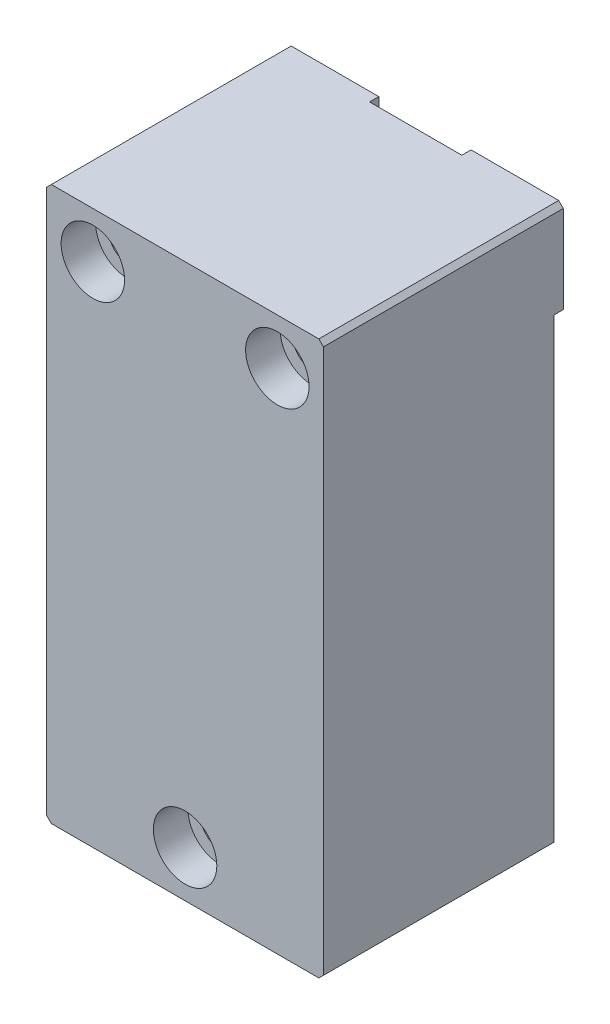
ISO-10303-21;
HEADER;
FILE_DESCRIPTION(('STEP AP214'),'2;1');
FILE_NAME('part.step','',(''),(''),'','','');
FILE_SCHEMA(('AUTOMOTIVE_DESIGN { 1 0 10303 214 1 1 1 1 }'));
ENDSEC;
DATA;
#1=APPLICATION_CONTEXT('core data for automotive mechanical design processes');
#2=APPLICATION_PROTOCOL_DEFINITION('international standard','automotive_design',2000,#1);
#3=PRODUCT_CONTEXT('',#1,'mechanical');
#4=PRODUCT('Part','Part','',(#3));
#5=PRODUCT_RELATED_PRODUCT_CATEGORY('part','',(#4));
#6=PRODUCT_DEFINITION_FORMATION('','',#4);
#7=PRODUCT_DEFINITION_CONTEXT('part definition',#1,'design');
#8=PRODUCT_DEFINITION('design','',#6,#7);
#9=PRODUCT_DEFINITION_SHAPE('','',#8);
#10=(LENGTH_UNIT() NAMED_UNIT(*) SI_UNIT(.MILLI.,.METRE.));
#11=(NAMED_UNIT(*) PLANE_ANGLE_UNIT() SI_UNIT($,.RADIAN.));
#12=(NAMED_UNIT(*) SI_UNIT($,.STERADIAN.) SOLID_ANGLE_UNIT());
#13=UNCERTAINTY_MEASURE_WITH_UNIT(LENGTH_MEASURE(1.E-05),#10,'distance_accuracy_value','');
#14=(GEOMETRIC_REPRESENTATION_CONTEXT(3) GLOBAL_UNCERTAINTY_ASSIGNED_CONTEXT((#13)) GLOBAL_UNIT_ASSIGNED_CONTEXT((#10,
#11,#12)) REPRESENTATION_CONTEXT('',''));
#15=CARTESIAN_POINT('',(0.,0.,0.));
#16=DIRECTION('',(0.,0.,1.));
#17=DIRECTION('',(1.,0.,0.));
#18=AXIS2_PLACEMENT_3D('',#15,#16,#17);
#19=CARTESIAN_POINT('',(-38.1,-114.3,0.));
#20=DIRECTION('',(0.,0.,1.));
#21=DIRECTION('',(1.,0.,0.));
#22=AXIS2_PLACEMENT_3D('',#19,#20,#21);
#23=PLANE('',#22);
#24=DIRECTION('',(0.,1.,0.));
#25=VECTOR('',#24,1.);
#26=CARTESIAN_POINT('',(38.1,38.1,0.));
#27=LINE('',#26,#25);
#28=CARTESIAN_POINT('',(38.1000000000001,-113.03,0.));
#29=VERTEX_POINT('',#28);
#30=CARTESIAN_POINT('',(38.1,12.7,0.));
#31=VERTEX_POINT('',#30);
#32=EDGE_CURVE('E247',#29,#31,#27,.T.);
#33=ORIENTED_EDGE('',*,*,#32,.F.);
#34=DIRECTION('',(0.707106781186551,0.707106781186544,0.));
#35=VECTOR('',#34,1.);
#36=CARTESIAN_POINT('',(38.1,-113.03,0.));
#37=LINE('',#36,#35);
#38=CARTESIAN_POINT('',(36.83,-114.3,0.));
#39=VERTEX_POINT('',#38);
#40=EDGE_CURVE('E356',#29,#39,#37,.F.);
#41=ORIENTED_EDGE('',*,*,#40,.T.);
#42=DIRECTION('',(1.,0.,0.));
#43=VECTOR('',#42,1.);
#44=CARTESIAN_POINT('',(-38.1,-114.3,0.));
#45=LINE('',#44,#43);
#46=CARTESIAN_POINT('',(12.7,-114.3,0.));
#47=VERTEX_POINT('',#46);
#48=EDGE_CURVE('E273',#47,#39,#45,.T.);
#49=ORIENTED_EDGE('',*,*,#48,.F.);
#50=DIRECTION('',(0.,-1.,0.));
#51=VECTOR('',#50,1.);
#52=CARTESIAN_POINT('',(12.7,-114.3,0.));
#53=LINE('',#52,#51);
#54=CARTESIAN_POINT('',(12.7,-88.9,0.));
#55=VERTEX_POINT('',#54);
#56=EDGE_CURVE('E181',#55,#47,#53,.T.);
#57=ORIENTED_EDGE('',*,*,#56,.F.);
#58=DIRECTION('',(1.,0.,0.));
#59=VECTOR('',#58,1.);
#60=CARTESIAN_POINT('',(12.7,-88.9,0.));
#61=LINE('',#60,#59);
#62=CARTESIAN_POINT('',(-12.7,-88.9,0.));
#63=VERTEX_POINT('',#62);
#64=EDGE_CURVE('E177',#63,#55,#61,.T.);
#65=ORIENTED_EDGE('',*,*,#64,.F.);
#66=DIRECTION('',(0.,1.,0.));
#67=VECTOR('',#66,1.);
#68=CARTESIAN_POINT('',(-12.7,-114.3,0.));
#69=LINE('',#68,#67);
#70=CARTESIAN_POINT('',(-12.7,-114.3,0.));
#71=VERTEX_POINT('',#70);
#72=EDGE_CURVE('E370',#71,#63,#69,.T.);
#73=ORIENTED_EDGE('',*,*,#72,.F.);
#74=CARTESIAN_POINT('',(-36.83,-114.3,0.));
#75=VERTEX_POINT('',#74);
#76=EDGE_CURVE('E251',#75,#71,#45,.T.);
#77=ORIENTED_EDGE('',*,*,#76,.F.);
#78=DIRECTION('',(0.707106781186548,-0.707106781186548,0.));
#79=VECTOR('',#78,1.);
#80=CARTESIAN_POINT('',(-36.83,-114.3,0.));
#81=LINE('',#80,#79);
#82=CARTESIAN_POINT('',(-38.1,-113.03,0.));
#83=VERTEX_POINT('',#82);
#84=EDGE_CURVE('E305',#75,#83,#81,.F.);
#85=ORIENTED_EDGE('',*,*,#84,.T.);
#86=DIRECTION('',(0.,-1.,0.));
#87=VECTOR('',#86,1.);
#88=CARTESIAN_POINT('',(-38.1,38.1,0.));
#89=LINE('',#88,#87);
#90=CARTESIAN_POINT('',(-38.1,12.7,0.));
#91=VERTEX_POINT('',#90);
#92=EDGE_CURVE('E268',#91,#83,#89,.T.);
#93=ORIENTED_EDGE('',*,*,#92,.F.);
#94=DIRECTION('',(-1.,0.,0.));
#95=VECTOR('',#94,1.);
#96=CARTESIAN_POINT('',(-38.1,12.7,0.));
#97=LINE('',#96,#95);
#98=CARTESIAN_POINT('',(-12.7,12.7,0.));
#99=VERTEX_POINT('',#98);
#100=EDGE_CURVE('E184',#99,#91,#97,.T.);
#101=ORIENTED_EDGE('',*,*,#100,.F.);
#102=DIRECTION('',(0.,-1.,0.));
#103=VECTOR('',#102,1.);
#104=CARTESIAN_POINT('',(-12.7,38.1,0.));
#105=LINE('',#104,#103);
#106=CARTESIAN_POINT('',(-12.7,38.1,0.));
#107=VERTEX_POINT('',#106);
#108=EDGE_CURVE('E182',#107,#99,#105,.T.);
#109=ORIENTED_EDGE('',*,*,#108,.F.);
#110=DIRECTION('',(-1.,0.,0.));
#111=VECTOR('',#110,1.);
#112=CARTESIAN_POINT('',(-38.1,38.1,0.));
#113=LINE('',#112,#111);
#114=CARTESIAN_POINT('',(12.7,38.1,0.));
#115=VERTEX_POINT('',#114);
#116=EDGE_CURVE('E250',#115,#107,#113,.T.);
#117=ORIENTED_EDGE('',*,*,#116,.F.);
#118=DIRECTION('',(0.,1.,0.));
#119=VECTOR('',#118,1.);
#120=CARTESIAN_POINT('',(12.7,38.1,0.));
#121=LINE('',#120,#119);
#122=CARTESIAN_POINT('',(12.7,12.7,0.));
#123=VERTEX_POINT('',#122);
#124=EDGE_CURVE('E211',#123,#115,#121,.T.);
#125=ORIENTED_EDGE('',*,*,#124,.F.);
#126=DIRECTION('',(-1.,0.,0.));
#127=VECTOR('',#126,1.);
#128=CARTESIAN_POINT('',(38.1,12.7,0.));
#129=LINE('',#128,#127);
#130=EDGE_CURVE('E207',#31,#123,#129,.T.);
#131=ORIENTED_EDGE('',*,*,#130,.F.);
#132=EDGE_LOOP('',(#33,#41,#49,#57,#65,#73,#77,#85,#93,#101,#109,#117,#125,#131));
#133=FACE_BOUND('',#132,.T.);
#134=ADVANCED_FACE('F32',(#133),#23,.F.);
#135=CARTESIAN_POINT('',(-38.1,38.1,63.5));
#136=DIRECTION('',(1.,0.,0.));
#137=DIRECTION('',(0.,1.,0.));
#138=AXIS2_PLACEMENT_3D('',#135,#136,#137);
#139=PLANE('',#138);
#140=ORIENTED_EDGE('',*,*,#92,.T.);
#141=DIRECTION('',(0.,0.,1.));
#142=VECTOR('',#141,1.);
#143=CARTESIAN_POINT('',(-38.1,-113.03,63.5));
#144=LINE('',#143,#142);
#145=CARTESIAN_POINT('',(-38.1,-113.03,63.5));
#146=VERTEX_POINT('',#145);
#147=EDGE_CURVE('E329',#83,#146,#144,.T.);
#148=ORIENTED_EDGE('',*,*,#147,.T.);
#149=DIRECTION('',(0.,-1.,0.));
#150=VECTOR('',#149,1.);
#151=CARTESIAN_POINT('',(-38.1,38.1,63.5));
#152=LINE('',#151,#150);
#153=CARTESIAN_POINT('',(-38.1,36.83,63.5));
#154=VERTEX_POINT('',#153);
#155=EDGE_CURVE('E262',#154,#146,#152,.T.);
#156=ORIENTED_EDGE('',*,*,#155,.F.);
#157=DIRECTION('',(0.,0.,-1.));
#158=VECTOR('',#157,1.);
#159=CARTESIAN_POINT('',(-38.1,36.83,63.5));
#160=LINE('',#159,#158);
#161=CARTESIAN_POINT('',(-38.1,36.83,-2.54));
#162=VERTEX_POINT('',#161);
#163=EDGE_CURVE('E334',#154,#162,#160,.T.);
#164=ORIENTED_EDGE('',*,*,#163,.T.);
#165=DIRECTION('',(0.,1.,0.));
#166=VECTOR('',#165,1.);
#167=CARTESIAN_POINT('',(-38.1,38.1,-2.54));
#168=LINE('',#167,#166);
#169=CARTESIAN_POINT('',(-38.1,12.7,-2.54));
#170=VERTEX_POINT('',#169);
#171=EDGE_CURVE('E190',#170,#162,#168,.T.);
#172=ORIENTED_EDGE('',*,*,#171,.F.);
#173=DIRECTION('',(0.,0.,1.));
#174=VECTOR('',#173,1.);
#175=CARTESIAN_POINT('',(-38.1,12.7,-2.54));
#176=LINE('',#175,#174);
#177=EDGE_CURVE('E197',#170,#91,#176,.T.);
#178=ORIENTED_EDGE('',*,*,#177,.T.);
#179=EDGE_LOOP('',(#140,#148,#156,#164,#172,#178));
#180=FACE_BOUND('',#179,.T.);
#181=ADVANCED_FACE('F346',(#180),#139,.F.);
#182=CARTESIAN_POINT('',(-38.1,-114.3,63.5));
#183=DIRECTION('',(0.,1.,0.));
#184=DIRECTION('',(0.,0.,1.));
#185=AXIS2_PLACEMENT_3D('',#182,#183,#184);
#186=PLANE('',#185);
#187=ORIENTED_EDGE('',*,*,#48,.T.);
#188=DIRECTION('',(0.,0.,1.));
#189=VECTOR('',#188,1.);
#190=CARTESIAN_POINT('',(36.83,-114.3,63.5));
#191=LINE('',#190,#189);
#192=CARTESIAN_POINT('',(36.83,-114.3,63.5));
#193=VERTEX_POINT('',#192);
#194=EDGE_CURVE('E361',#39,#193,#191,.T.);
#195=ORIENTED_EDGE('',*,*,#194,.T.);
#196=DIRECTION('',(1.,0.,0.));
#197=VECTOR('',#196,1.);
#198=CARTESIAN_POINT('',(-38.1,-114.3,63.5));
#199=LINE('',#198,#197);
#200=CARTESIAN_POINT('',(-36.83,-114.3,63.5));
#201=VERTEX_POINT('',#200);
#202=EDGE_CURVE('E311',#201,#193,#199,.T.);
#203=ORIENTED_EDGE('',*,*,#202,.F.);
#204=DIRECTION('',(0.,0.,-1.));
#205=VECTOR('',#204,1.);
#206=CARTESIAN_POINT('',(-36.83,-114.3,63.5));
#207=LINE('',#206,#205);
#208=EDGE_CURVE('E331',#201,#75,#207,.T.);
#209=ORIENTED_EDGE('',*,*,#208,.T.);
#210=ORIENTED_EDGE('',*,*,#76,.T.);
#211=DIRECTION('',(0.,0.,1.));
#212=VECTOR('',#211,1.);
#213=CARTESIAN_POINT('',(-12.7,-114.3,-2.54));
#214=LINE('',#213,#212);
#215=CARTESIAN_POINT('',(-12.7,-114.3,-2.54));
#216=VERTEX_POINT('',#215);
#217=EDGE_CURVE('E164',#216,#71,#214,.T.);
#218=ORIENTED_EDGE('',*,*,#217,.F.);
#219=DIRECTION('',(-1.,0.,0.));
#220=VECTOR('',#219,1.);
#221=CARTESIAN_POINT('',(12.7,-114.3,-2.54));
#222=LINE('',#221,#220);
#223=CARTESIAN_POINT('',(12.7,-114.3,-2.54));
#224=VERTEX_POINT('',#223);
#225=EDGE_CURVE('E156',#224,#216,#222,.T.);
#226=ORIENTED_EDGE('',*,*,#225,.F.);
#227=DIRECTION('',(0.,0.,1.));
#228=VECTOR('',#227,1.);
#229=CARTESIAN_POINT('',(12.7,-114.3,-2.54));
#230=LINE('',#229,#228);
#231=EDGE_CURVE('E161',#224,#47,#230,.T.);
#232=ORIENTED_EDGE('',*,*,#231,.T.);
#233=EDGE_LOOP('',(#187,#195,#203,#209,#210,#218,#226,#232));
#234=FACE_BOUND('',#233,.T.);
#235=ADVANCED_FACE('F159',(#234),#186,.F.);
#236=CARTESIAN_POINT('',(38.1,38.1,63.5));
#237=DIRECTION('',(-1.,0.,0.));
#238=DIRECTION('',(0.,-1.,0.));
#239=AXIS2_PLACEMENT_3D('',#236,#237,#238);
#240=PLANE('',#239);
#241=DIRECTION('',(0.,1.,0.));
#242=VECTOR('',#241,1.);
#243=CARTESIAN_POINT('',(38.1,38.1,63.5));
#244=LINE('',#243,#242);
#245=CARTESIAN_POINT('',(38.1000000000001,-113.03,63.5));
#246=VERTEX_POINT('',#245);
#247=CARTESIAN_POINT('',(38.1,36.8300000000001,63.5));
#248=VERTEX_POINT('',#247);
#249=EDGE_CURVE('E307',#246,#248,#244,.T.);
#250=ORIENTED_EDGE('',*,*,#249,.F.);
#251=DIRECTION('',(0.,0.,-1.));
#252=VECTOR('',#251,1.);
#253=CARTESIAN_POINT('',(38.1,-113.03,63.5));
#254=LINE('',#253,#252);
#255=EDGE_CURVE('E302',#246,#29,#254,.T.);
#256=ORIENTED_EDGE('',*,*,#255,.T.);
#257=ORIENTED_EDGE('',*,*,#32,.T.);
#258=DIRECTION('',(0.,0.,1.));
#259=VECTOR('',#258,1.);
#260=CARTESIAN_POINT('',(38.1,12.7,-2.54));
#261=LINE('',#260,#259);
#262=CARTESIAN_POINT('',(38.1,12.7,-2.54));
#263=VERTEX_POINT('',#262);
#264=EDGE_CURVE('E266',#263,#31,#261,.T.);
#265=ORIENTED_EDGE('',*,*,#264,.F.);
#266=DIRECTION('',(0.,-1.,0.));
#267=VECTOR('',#266,1.);
#268=CARTESIAN_POINT('',(38.1,38.1,-2.54));
#269=LINE('',#268,#267);
#270=CARTESIAN_POINT('',(38.1,36.83,-2.54));
#271=VERTEX_POINT('',#270);
#272=EDGE_CURVE('E208',#271,#263,#269,.T.);
#273=ORIENTED_EDGE('',*,*,#272,.F.);
#274=DIRECTION('',(0.,0.,1.));
#275=VECTOR('',#274,1.);
#276=CARTESIAN_POINT('',(38.1,36.83,63.5));
#277=LINE('',#276,#275);
#278=EDGE_CURVE('E252',#271,#248,#277,.T.);
#279=ORIENTED_EDGE('',*,*,#278,.T.);
#280=EDGE_LOOP('',(#250,#256,#257,#265,#273,#279));
#281=FACE_BOUND('',#280,.T.);
#282=ADVANCED_FACE('F298',(#281),#240,.F.);
#283=CARTESIAN_POINT('',(-38.1,38.1,63.5));
#284=DIRECTION('',(0.,-1.,0.));
#285=DIRECTION('',(1.,0.,0.));
#286=AXIS2_PLACEMENT_3D('',#283,#284,#285);
#287=PLANE('',#286);
#288=DIRECTION('',(1.,0.,0.));
#289=VECTOR('',#288,1.);
#290=CARTESIAN_POINT('',(-38.1,38.1,-2.54));
#291=LINE('',#290,#289);
#292=CARTESIAN_POINT('',(-36.8299999999999,38.1,-2.54));
#293=VERTEX_POINT('',#292);
#294=CARTESIAN_POINT('',(-12.7,38.1,-2.54));
#295=VERTEX_POINT('',#294);
#296=EDGE_CURVE('E192',#293,#295,#291,.T.);
#297=ORIENTED_EDGE('',*,*,#296,.F.);
#298=DIRECTION('',(0.,0.,1.));
#299=VECTOR('',#298,1.);
#300=CARTESIAN_POINT('',(-36.8299999999999,38.1,63.5));
#301=LINE('',#300,#299);
#302=CARTESIAN_POINT('',(-36.8299999999999,38.1,63.5));
#303=VERTEX_POINT('',#302);
#304=EDGE_CURVE('E40',#293,#303,#301,.T.);
#305=ORIENTED_EDGE('',*,*,#304,.T.);
#306=DIRECTION('',(-1.,0.,0.));
#307=VECTOR('',#306,1.);
#308=CARTESIAN_POINT('',(-38.1,38.1,63.5));
#309=LINE('',#308,#307);
#310=CARTESIAN_POINT('',(36.83,38.1,63.5));
#311=VERTEX_POINT('',#310);
#312=EDGE_CURVE('E303',#311,#303,#309,.T.);
#313=ORIENTED_EDGE('',*,*,#312,.F.);
#314=DIRECTION('',(0.,0.,-1.));
#315=VECTOR('',#314,1.);
#316=CARTESIAN_POINT('',(36.83,38.1,63.5));
#317=LINE('',#316,#315);
#318=CARTESIAN_POINT('',(36.83,38.1,-2.54));
#319=VERTEX_POINT('',#318);
#320=EDGE_CURVE('E292',#311,#319,#317,.T.);
#321=ORIENTED_EDGE('',*,*,#320,.T.);
#322=DIRECTION('',(1.,0.,0.));
#323=VECTOR('',#322,1.);
#324=CARTESIAN_POINT('',(38.1,38.1,-2.54));
#325=LINE('',#324,#323);
#326=CARTESIAN_POINT('',(12.7,38.1,-2.54));
#327=VERTEX_POINT('',#326);
#328=EDGE_CURVE('E215',#327,#319,#325,.T.);
#329=ORIENTED_EDGE('',*,*,#328,.F.);
#330=DIRECTION('',(0.,0.,1.));
#331=VECTOR('',#330,1.);
#332=CARTESIAN_POINT('',(12.7,38.1,-2.54));
#333=LINE('',#332,#331);
#334=EDGE_CURVE('E218',#327,#115,#333,.T.);
#335=ORIENTED_EDGE('',*,*,#334,.T.);
#336=ORIENTED_EDGE('',*,*,#116,.T.);
#337=DIRECTION('',(0.,0.,1.));
#338=VECTOR('',#337,1.);
#339=CARTESIAN_POINT('',(-12.7,38.1,-2.54));
#340=LINE('',#339,#338);
#341=EDGE_CURVE('E205',#295,#107,#340,.T.);
#342=ORIENTED_EDGE('',*,*,#341,.F.);
#343=EDGE_LOOP('',(#297,#305,#313,#321,#329,#335,#336,#342));
#344=FACE_BOUND('',#343,.T.);
#345=ADVANCED_FACE('F288',(#344),#287,.F.);
#346=CARTESIAN_POINT('',(-38.1,-114.3,63.5));
#347=DIRECTION('',(0.,0.,1.));
#348=DIRECTION('',(1.,0.,0.));
#349=AXIS2_PLACEMENT_3D('',#346,#347,#348);
#350=PLANE('',#349);
#351=CARTESIAN_POINT('',(-25.4,25.4,63.5));
#352=DIRECTION('',(0.,0.,1.));
#353=DIRECTION('',(1.,0.,0.));
#354=AXIS2_PLACEMENT_3D('',#351,#352,#353);
#355=CIRCLE('',#354,8.7376);
#356=CARTESIAN_POINT('',(-16.6624,25.4,63.5));
#357=VERTEX_POINT('',#356);
#358=EDGE_CURVE('E402',#357,#357,#355,.T.);
#359=ORIENTED_EDGE('',*,*,#358,.F.);
#360=EDGE_LOOP('',(#359));
#361=FACE_BOUND('',#360,.T.);
#362=CARTESIAN_POINT('',(25.4,25.4,63.5));
#363=DIRECTION('',(0.,0.,1.));
#364=DIRECTION('',(1.,0.,0.));
#365=AXIS2_PLACEMENT_3D('',#362,#363,#364);
#366=CIRCLE('',#365,8.7376);
#367=CARTESIAN_POINT('',(34.1376,25.4,63.5));
#368=VERTEX_POINT('',#367);
#369=EDGE_CURVE('E245',#368,#368,#366,.T.);
#370=ORIENTED_EDGE('',*,*,#369,.F.);
#371=EDGE_LOOP('',(#370));
#372=FACE_BOUND('',#371,.T.);
#373=CARTESIAN_POINT('',(0.,-101.6,63.5));
#374=DIRECTION('',(0.,0.,1.));
#375=DIRECTION('',(1.,0.,0.));
#376=AXIS2_PLACEMENT_3D('',#373,#374,#375);
#377=CIRCLE('',#376,8.7376);
#378=CARTESIAN_POINT('',(8.7376,-101.6,63.5));
#379=VERTEX_POINT('',#378);
#380=EDGE_CURVE('E240',#379,#379,#377,.T.);
#381=ORIENTED_EDGE('',*,*,#380,.F.);
#382=EDGE_LOOP('',(#381));
#383=FACE_BOUND('',#382,.T.);
#384=ORIENTED_EDGE('',*,*,#202,.T.);
#385=DIRECTION('',(-0.707106781186551,-0.707106781186544,0.));
#386=VECTOR('',#385,1.);
#387=CARTESIAN_POINT('',(-0.635000000000385,-151.765,63.5));
#388=LINE('',#387,#386);
#389=EDGE_CURVE('E332',#193,#246,#388,.F.);
#390=ORIENTED_EDGE('',*,*,#389,.T.);
#391=ORIENTED_EDGE('',*,*,#249,.T.);
#392=DIRECTION('',(0.707106781186548,-0.707106781186548,0.));
#393=VECTOR('',#392,1.);
#394=CARTESIAN_POINT('',(75.565,-0.634999999999997,63.5));
#395=LINE('',#394,#393);
#396=EDGE_CURVE('E301',#248,#311,#395,.F.);
#397=ORIENTED_EDGE('',*,*,#396,.T.);
#398=ORIENTED_EDGE('',*,*,#312,.T.);
#399=DIRECTION('',(0.707106781186548,0.707106781186548,0.));
#400=VECTOR('',#399,1.);
#401=CARTESIAN_POINT('',(-113.665,-38.735,63.5));
#402=LINE('',#401,#400);
#403=EDGE_CURVE('E321',#303,#154,#402,.F.);
#404=ORIENTED_EDGE('',*,*,#403,.T.);
#405=ORIENTED_EDGE('',*,*,#155,.T.);
#406=DIRECTION('',(-0.707106781186548,0.707106781186548,0.));
#407=VECTOR('',#406,1.);
#408=CARTESIAN_POINT('',(-37.465,-113.665,63.5));
#409=LINE('',#408,#407);
#410=EDGE_CURVE('E319',#146,#201,#409,.F.);
#411=ORIENTED_EDGE('',*,*,#410,.T.);
#412=EDGE_LOOP('',(#384,#390,#391,#397,#398,#404,#405,#411));
#413=FACE_BOUND('',#412,.T.);
#414=ADVANCED_FACE('F318',(#361,#372,#383,#413),#350,.T.);
#415=CARTESIAN_POINT('',(38.1,12.7,-2.54));
#416=DIRECTION('',(0.,1.,0.));
#417=DIRECTION('',(0.,0.,1.));
#418=AXIS2_PLACEMENT_3D('',#415,#416,#417);
#419=PLANE('',#418);
#420=ORIENTED_EDGE('',*,*,#130,.T.);
#421=DIRECTION('',(0.,0.,1.));
#422=VECTOR('',#421,1.);
#423=CARTESIAN_POINT('',(12.7,12.7,-2.54));
#424=LINE('',#423,#422);
#425=CARTESIAN_POINT('',(12.7,12.7,-2.54));
#426=VERTEX_POINT('',#425);
#427=EDGE_CURVE('E221',#426,#123,#424,.T.);
#428=ORIENTED_EDGE('',*,*,#427,.F.);
#429=DIRECTION('',(-1.,0.,0.));
#430=VECTOR('',#429,1.);
#431=CARTESIAN_POINT('',(38.1,12.7,-2.54));
#432=LINE('',#431,#430);
#433=EDGE_CURVE('E210',#263,#426,#432,.T.);
#434=ORIENTED_EDGE('',*,*,#433,.F.);
#435=ORIENTED_EDGE('',*,*,#264,.T.);
#436=EDGE_LOOP('',(#420,#428,#434,#435));
#437=FACE_BOUND('',#436,.T.);
#438=ADVANCED_FACE('F280',(#437),#419,.F.);
#439=CARTESIAN_POINT('',(12.7,38.1,-2.54));
#440=DIRECTION('',(1.,0.,0.));
#441=DIRECTION('',(0.,1.,0.));
#442=AXIS2_PLACEMENT_3D('',#439,#440,#441);
#443=PLANE('',#442);
#444=ORIENTED_EDGE('',*,*,#124,.T.);
#445=ORIENTED_EDGE('',*,*,#334,.F.);
#446=DIRECTION('',(0.,1.,0.));
#447=VECTOR('',#446,1.);
#448=CARTESIAN_POINT('',(12.7,38.1,-2.54));
#449=LINE('',#448,#447);
#450=EDGE_CURVE('E213',#426,#327,#449,.T.);
#451=ORIENTED_EDGE('',*,*,#450,.F.);
#452=ORIENTED_EDGE('',*,*,#427,.T.);
#453=EDGE_LOOP('',(#444,#445,#451,#452));
#454=FACE_BOUND('',#453,.T.);
#455=ADVANCED_FACE('F278',(#454),#443,.F.);
#456=CARTESIAN_POINT('',(38.1,12.7,-2.54));
#457=DIRECTION('',(0.,0.,-1.));
#458=DIRECTION('',(-1.,0.,0.));
#459=AXIS2_PLACEMENT_3D('',#456,#457,#458);
#460=PLANE('',#459);
#461=CARTESIAN_POINT('',(25.4,25.4,-2.54));
#462=DIRECTION('',(0.,0.,-1.));
#463=DIRECTION('',(-1.,0.,0.));
#464=AXIS2_PLACEMENT_3D('',#461,#462,#463);
#465=CIRCLE('',#464,5.15873999999999);
#466=CARTESIAN_POINT('',(20.24126,25.4,-2.54));
#467=VERTEX_POINT('',#466);
#468=EDGE_CURVE('E237',#467,#467,#465,.T.);
#469=ORIENTED_EDGE('',*,*,#468,.F.);
#470=EDGE_LOOP('',(#469));
#471=FACE_BOUND('',#470,.T.);
#472=ORIENTED_EDGE('',*,*,#328,.T.);
#473=DIRECTION('',(-0.707106781186548,0.707106781186548,0.));
#474=VECTOR('',#473,1.);
#475=CARTESIAN_POINT('',(50.165,24.765,-2.54));
#476=LINE('',#475,#474);
#477=EDGE_CURVE('E11',#319,#271,#476,.F.);
#478=ORIENTED_EDGE('',*,*,#477,.T.);
#479=ORIENTED_EDGE('',*,*,#272,.T.);
#480=ORIENTED_EDGE('',*,*,#433,.T.);
#481=ORIENTED_EDGE('',*,*,#450,.T.);
#482=EDGE_LOOP('',(#472,#478,#479,#480,#481));
#483=FACE_BOUND('',#482,.T.);
#484=ADVANCED_FACE('F294',(#471,#483),#460,.T.);
#485=CARTESIAN_POINT('',(-12.7,38.1,-2.54));
#486=DIRECTION('',(-1.,0.,0.));
#487=DIRECTION('',(0.,-1.,0.));
#488=AXIS2_PLACEMENT_3D('',#485,#486,#487);
#489=PLANE('',#488);
#490=ORIENTED_EDGE('',*,*,#108,.T.);
#491=DIRECTION('',(0.,0.,1.));
#492=VECTOR('',#491,1.);
#493=CARTESIAN_POINT('',(-12.7,12.7,-2.54));
#494=LINE('',#493,#492);
#495=CARTESIAN_POINT('',(-12.7,12.7,-2.54));
#496=VERTEX_POINT('',#495);
#497=EDGE_CURVE('E202',#496,#99,#494,.T.);
#498=ORIENTED_EDGE('',*,*,#497,.F.);
#499=DIRECTION('',(0.,-1.,0.));
#500=VECTOR('',#499,1.);
#501=CARTESIAN_POINT('',(-12.7,38.1,-2.54));
#502=LINE('',#501,#500);
#503=EDGE_CURVE('E194',#295,#496,#502,.T.);
#504=ORIENTED_EDGE('',*,*,#503,.F.);
#505=ORIENTED_EDGE('',*,*,#341,.T.);
#506=EDGE_LOOP('',(#490,#498,#504,#505));
#507=FACE_BOUND('',#506,.T.);
#508=ADVANCED_FACE('F495',(#507),#489,.F.);
#509=CARTESIAN_POINT('',(-38.1,12.7,-2.54));
#510=DIRECTION('',(0.,1.,0.));
#511=DIRECTION('',(-1.,0.,0.));
#512=AXIS2_PLACEMENT_3D('',#509,#510,#511);
#513=PLANE('',#512);
#514=ORIENTED_EDGE('',*,*,#100,.T.);
#515=ORIENTED_EDGE('',*,*,#177,.F.);
#516=DIRECTION('',(-1.,0.,0.));
#517=VECTOR('',#516,1.);
#518=CARTESIAN_POINT('',(-38.1,12.7,-2.54));
#519=LINE('',#518,#517);
#520=EDGE_CURVE('E196',#496,#170,#519,.T.);
#521=ORIENTED_EDGE('',*,*,#520,.F.);
#522=ORIENTED_EDGE('',*,*,#497,.T.);
#523=EDGE_LOOP('',(#514,#515,#521,#522));
#524=FACE_BOUND('',#523,.T.);
#525=ADVANCED_FACE('F352',(#524),#513,.F.);
#526=CARTESIAN_POINT('',(-38.1,12.7,-2.54));
#527=DIRECTION('',(0.,0.,1.));
#528=DIRECTION('',(1.,0.,0.));
#529=AXIS2_PLACEMENT_3D('',#526,#527,#528);
#530=PLANE('',#529);
#531=CARTESIAN_POINT('',(-25.4,25.4,-2.54));
#532=DIRECTION('',(0.,0.,1.));
#533=DIRECTION('',(1.,0.,0.));
#534=AXIS2_PLACEMENT_3D('',#531,#532,#533);
#535=CIRCLE('',#534,5.15873999999999);
#536=CARTESIAN_POINT('',(-20.24126,25.4,-2.54));
#537=VERTEX_POINT('',#536);
#538=EDGE_CURVE('E242',#537,#537,#535,.T.);
#539=ORIENTED_EDGE('',*,*,#538,.T.);
#540=EDGE_LOOP('',(#539));
#541=FACE_BOUND('',#540,.T.);
#542=ORIENTED_EDGE('',*,*,#171,.T.);
#543=DIRECTION('',(-0.707106781186548,-0.707106781186548,0.));
#544=VECTOR('',#543,1.);
#545=CARTESIAN_POINT('',(-38.1,36.83,-2.54));
#546=LINE('',#545,#544);
#547=EDGE_CURVE('E53',#162,#293,#546,.F.);
#548=ORIENTED_EDGE('',*,*,#547,.T.);
#549=ORIENTED_EDGE('',*,*,#296,.T.);
#550=ORIENTED_EDGE('',*,*,#503,.T.);
#551=ORIENTED_EDGE('',*,*,#520,.T.);
#552=EDGE_LOOP('',(#542,#548,#549,#550,#551));
#553=FACE_BOUND('',#552,.T.);
#554=ADVANCED_FACE('F347',(#541,#553),#530,.F.);
#555=CARTESIAN_POINT('',(12.7,-114.3,-2.54));
#556=DIRECTION('',(-1.,0.,0.));
#557=DIRECTION('',(0.,0.,1.));
#558=AXIS2_PLACEMENT_3D('',#555,#556,#557);
#559=PLANE('',#558);
#560=ORIENTED_EDGE('',*,*,#56,.T.);
#561=ORIENTED_EDGE('',*,*,#231,.F.);
#562=DIRECTION('',(0.,-1.,0.));
#563=VECTOR('',#562,1.);
#564=CARTESIAN_POINT('',(12.7,-114.3,-2.54));
#565=LINE('',#564,#563);
#566=CARTESIAN_POINT('',(12.7,-88.9,-2.54));
#567=VERTEX_POINT('',#566);
#568=EDGE_CURVE('E168',#567,#224,#565,.T.);
#569=ORIENTED_EDGE('',*,*,#568,.F.);
#570=DIRECTION('',(0.,0.,1.));
#571=VECTOR('',#570,1.);
#572=CARTESIAN_POINT('',(12.7,-88.9,-2.54));
#573=LINE('',#572,#571);
#574=EDGE_CURVE('E378',#567,#55,#573,.T.);
#575=ORIENTED_EDGE('',*,*,#574,.T.);
#576=EDGE_LOOP('',(#560,#561,#569,#575));
#577=FACE_BOUND('',#576,.T.);
#578=ADVANCED_FACE('F179',(#577),#559,.F.);
#579=CARTESIAN_POINT('',(-12.7,-114.3,-2.54));
#580=DIRECTION('',(1.,0.,0.));
#581=DIRECTION('',(0.,1.,0.));
#582=AXIS2_PLACEMENT_3D('',#579,#580,#581);
#583=PLANE('',#582);
#584=ORIENTED_EDGE('',*,*,#72,.T.);
#585=DIRECTION('',(0.,0.,1.));
#586=VECTOR('',#585,1.);
#587=CARTESIAN_POINT('',(-12.7,-88.9,-2.54));
#588=LINE('',#587,#586);
#589=CARTESIAN_POINT('',(-12.7,-88.9,-2.54));
#590=VERTEX_POINT('',#589);
#591=EDGE_CURVE('E186',#590,#63,#588,.T.);
#592=ORIENTED_EDGE('',*,*,#591,.F.);
#593=DIRECTION('',(0.,1.,0.));
#594=VECTOR('',#593,1.);
#595=CARTESIAN_POINT('',(-12.7,-114.3,-2.54));
#596=LINE('',#595,#594);
#597=EDGE_CURVE('E167',#216,#590,#596,.T.);
#598=ORIENTED_EDGE('',*,*,#597,.F.);
#599=ORIENTED_EDGE('',*,*,#217,.T.);
#600=EDGE_LOOP('',(#584,#592,#598,#599));
#601=FACE_BOUND('',#600,.T.);
#602=ADVANCED_FACE('F368',(#601),#583,.F.);
#603=CARTESIAN_POINT('',(12.7,-88.9,-2.54));
#604=DIRECTION('',(0.,-1.,0.));
#605=DIRECTION('',(0.,0.,-1.));
#606=AXIS2_PLACEMENT_3D('',#603,#604,#605);
#607=PLANE('',#606);
#608=ORIENTED_EDGE('',*,*,#64,.T.);
#609=ORIENTED_EDGE('',*,*,#574,.F.);
#610=DIRECTION('',(1.,0.,0.));
#611=VECTOR('',#610,1.);
#612=CARTESIAN_POINT('',(12.7,-88.9,-2.54));
#613=LINE('',#612,#611);
#614=EDGE_CURVE('E173',#590,#567,#613,.T.);
#615=ORIENTED_EDGE('',*,*,#614,.F.);
#616=ORIENTED_EDGE('',*,*,#591,.T.);
#617=EDGE_LOOP('',(#608,#609,#615,#616));
#618=FACE_BOUND('',#617,.T.);
#619=ADVANCED_FACE('F380',(#618),#607,.F.);
#620=CARTESIAN_POINT('',(12.7,-88.9,-2.54));
#621=DIRECTION('',(0.,0.,1.));
#622=DIRECTION('',(1.,0.,0.));
#623=AXIS2_PLACEMENT_3D('',#620,#621,#622);
#624=PLANE('',#623);
#625=CARTESIAN_POINT('',(0.,-101.6,-2.54));
#626=DIRECTION('',(0.,0.,1.));
#627=DIRECTION('',(1.,0.,0.));
#628=AXIS2_PLACEMENT_3D('',#625,#626,#627);
#629=CIRCLE('',#628,5.15873999999999);
#630=CARTESIAN_POINT('',(5.15874,-101.6,-2.54));
#631=VERTEX_POINT('',#630);
#632=EDGE_CURVE('E233',#631,#631,#629,.T.);
#633=ORIENTED_EDGE('',*,*,#632,.T.);
#634=EDGE_LOOP('',(#633));
#635=FACE_BOUND('',#634,.T.);
#636=ORIENTED_EDGE('',*,*,#568,.T.);
#637=ORIENTED_EDGE('',*,*,#225,.T.);
#638=ORIENTED_EDGE('',*,*,#597,.T.);
#639=ORIENTED_EDGE('',*,*,#614,.T.);
#640=EDGE_LOOP('',(#636,#637,#638,#639));
#641=FACE_BOUND('',#640,.T.);
#642=ADVANCED_FACE('F171',(#635,#641),#624,.F.);
#643=CARTESIAN_POINT('',(0.,-101.6,63.5));
#644=DIRECTION('',(0.,0.,1.));
#645=DIRECTION('',(1.,0.,0.));
#646=AXIS2_PLACEMENT_3D('',#643,#644,#645);
#647=CYLINDRICAL_SURFACE('',#646,5.15873999999999);
#648=CARTESIAN_POINT('',(0.,-101.6,53.975));
#649=DIRECTION('',(0.,0.,1.));
#650=DIRECTION('',(1.,0.,0.));
#651=AXIS2_PLACEMENT_3D('',#648,#649,#650);
#652=CIRCLE('',#651,5.15874000000001);
#653=CARTESIAN_POINT('',(5.15874000000001,-101.6,53.975));
#654=VERTEX_POINT('',#653);
#655=EDGE_CURVE('E236',#654,#654,#652,.T.);
#656=ORIENTED_EDGE('',*,*,#655,.T.);
#657=EDGE_LOOP('',(#656));
#658=FACE_BOUND('',#657,.T.);
#659=ORIENTED_EDGE('',*,*,#632,.F.);
#660=EDGE_LOOP('',(#659));
#661=FACE_BOUND('',#660,.T.);
#662=ADVANCED_FACE('F428',(#658,#661),#647,.F.);
#663=CARTESIAN_POINT('',(5.15874000000001,-101.6,53.975));
#664=DIRECTION('',(0.,0.,-1.));
#665=DIRECTION('',(-1.,0.,0.));
#666=AXIS2_PLACEMENT_3D('',#663,#664,#665);
#667=PLANE('',#666);
#668=ORIENTED_EDGE('',*,*,#655,.F.);
#669=EDGE_LOOP('',(#668));
#670=FACE_BOUND('',#669,.T.);
#671=CARTESIAN_POINT('',(0.,-101.6,53.975));
#672=DIRECTION('',(0.,0.,1.));
#673=DIRECTION('',(1.,0.,0.));
#674=AXIS2_PLACEMENT_3D('',#671,#672,#673);
#675=CIRCLE('',#674,8.7376);
#676=CARTESIAN_POINT('',(8.7376,-101.6,53.975));
#677=VERTEX_POINT('',#676);
#678=EDGE_CURVE('E385',#677,#677,#675,.T.);
#679=ORIENTED_EDGE('',*,*,#678,.T.);
#680=EDGE_LOOP('',(#679));
#681=FACE_BOUND('',#680,.T.);
#682=ADVANCED_FACE('F418',(#670,#681),#667,.F.);
#683=CARTESIAN_POINT('',(0.,-101.6,63.5));
#684=DIRECTION('',(0.,0.,1.));
#685=DIRECTION('',(1.,0.,0.));
#686=AXIS2_PLACEMENT_3D('',#683,#684,#685);
#687=CYLINDRICAL_SURFACE('',#686,8.7376);
#688=ORIENTED_EDGE('',*,*,#678,.F.);
#689=EDGE_LOOP('',(#688));
#690=FACE_BOUND('',#689,.T.);
#691=ORIENTED_EDGE('',*,*,#380,.T.);
#692=EDGE_LOOP('',(#691));
#693=FACE_BOUND('',#692,.T.);
#694=ADVANCED_FACE('F415',(#690,#693),#687,.F.);
#695=CARTESIAN_POINT('',(25.4,25.4,63.5));
#696=DIRECTION('',(0.,0.,1.));
#697=DIRECTION('',(1.,0.,0.));
#698=AXIS2_PLACEMENT_3D('',#695,#696,#697);
#699=CYLINDRICAL_SURFACE('',#698,5.15873999999999);
#700=ORIENTED_EDGE('',*,*,#468,.T.);
#701=EDGE_LOOP('',(#700));
#702=FACE_BOUND('',#701,.T.);
#703=CARTESIAN_POINT('',(25.4,25.4,53.975));
#704=DIRECTION('',(0.,0.,1.));
#705=DIRECTION('',(1.,0.,0.));
#706=AXIS2_PLACEMENT_3D('',#703,#704,#705);
#707=CIRCLE('',#706,5.15874000000001);
#708=CARTESIAN_POINT('',(30.55874,25.4,53.975));
#709=VERTEX_POINT('',#708);
#710=EDGE_CURVE('E241',#709,#709,#707,.T.);
#711=ORIENTED_EDGE('',*,*,#710,.T.);
#712=EDGE_LOOP('',(#711));
#713=FACE_BOUND('',#712,.T.);
#714=ADVANCED_FACE('F417',(#702,#713),#699,.F.);
#715=CARTESIAN_POINT('',(30.55874,25.4,53.975));
#716=DIRECTION('',(0.,0.,-1.));
#717=DIRECTION('',(-1.,0.,0.));
#718=AXIS2_PLACEMENT_3D('',#715,#716,#717);
#719=PLANE('',#718);
#720=ORIENTED_EDGE('',*,*,#710,.F.);
#721=EDGE_LOOP('',(#720));
#722=FACE_BOUND('',#721,.T.);
#723=CARTESIAN_POINT('',(25.4,25.4,53.975));
#724=DIRECTION('',(0.,0.,1.));
#725=DIRECTION('',(1.,0.,0.));
#726=AXIS2_PLACEMENT_3D('',#723,#724,#725);
#727=CIRCLE('',#726,8.7376);
#728=CARTESIAN_POINT('',(34.1376,25.4,53.975));
#729=VERTEX_POINT('',#728);
#730=EDGE_CURVE('E392',#729,#729,#727,.T.);
#731=ORIENTED_EDGE('',*,*,#730,.T.);
#732=EDGE_LOOP('',(#731));
#733=FACE_BOUND('',#732,.T.);
#734=ADVANCED_FACE('F425',(#722,#733),#719,.F.);
#735=CARTESIAN_POINT('',(25.4,25.4,63.5));
#736=DIRECTION('',(0.,0.,1.));
#737=DIRECTION('',(1.,0.,0.));
#738=AXIS2_PLACEMENT_3D('',#735,#736,#737);
#739=CYLINDRICAL_SURFACE('',#738,8.7376);
#740=ORIENTED_EDGE('',*,*,#730,.F.);
#741=EDGE_LOOP('',(#740));
#742=FACE_BOUND('',#741,.T.);
#743=ORIENTED_EDGE('',*,*,#369,.T.);
#744=EDGE_LOOP('',(#743));
#745=FACE_BOUND('',#744,.T.);
#746=ADVANCED_FACE('F568',(#742,#745),#739,.F.);
#747=CARTESIAN_POINT('',(-25.4,25.4,63.5));
#748=DIRECTION('',(0.,0.,1.));
#749=DIRECTION('',(1.,0.,0.));
#750=AXIS2_PLACEMENT_3D('',#747,#748,#749);
#751=CYLINDRICAL_SURFACE('',#750,5.15873999999999);
#752=CARTESIAN_POINT('',(-25.4,25.4,53.975));
#753=DIRECTION('',(0.,0.,1.));
#754=DIRECTION('',(1.,0.,0.));
#755=AXIS2_PLACEMENT_3D('',#752,#753,#754);
#756=CIRCLE('',#755,5.15874000000001);
#757=CARTESIAN_POINT('',(-20.24126,25.4,53.975));
#758=VERTEX_POINT('',#757);
#759=EDGE_CURVE('E246',#758,#758,#756,.T.);
#760=ORIENTED_EDGE('',*,*,#759,.T.);
#761=EDGE_LOOP('',(#760));
#762=FACE_BOUND('',#761,.T.);
#763=ORIENTED_EDGE('',*,*,#538,.F.);
#764=EDGE_LOOP('',(#763));
#765=FACE_BOUND('',#764,.T.);
#766=ADVANCED_FACE('F558',(#762,#765),#751,.F.);
#767=CARTESIAN_POINT('',(-20.24126,25.4,53.975));
#768=DIRECTION('',(0.,0.,-1.));
#769=DIRECTION('',(-1.,0.,0.));
#770=AXIS2_PLACEMENT_3D('',#767,#768,#769);
#771=PLANE('',#770);
#772=ORIENTED_EDGE('',*,*,#759,.F.);
#773=EDGE_LOOP('',(#772));
#774=FACE_BOUND('',#773,.T.);
#775=CARTESIAN_POINT('',(-25.4,25.4,53.975));
#776=DIRECTION('',(0.,0.,1.));
#777=DIRECTION('',(1.,0.,0.));
#778=AXIS2_PLACEMENT_3D('',#775,#776,#777);
#779=CIRCLE('',#778,8.7376);
#780=CARTESIAN_POINT('',(-16.6624,25.4,53.975));
#781=VERTEX_POINT('',#780);
#782=EDGE_CURVE('E399',#781,#781,#779,.T.);
#783=ORIENTED_EDGE('',*,*,#782,.T.);
#784=EDGE_LOOP('',(#783));
#785=FACE_BOUND('',#784,.T.);
#786=ADVANCED_FACE('F548',(#774,#785),#771,.F.);
#787=CARTESIAN_POINT('',(-25.4,25.4,63.5));
#788=DIRECTION('',(0.,0.,1.));
#789=DIRECTION('',(1.,0.,0.));
#790=AXIS2_PLACEMENT_3D('',#787,#788,#789);
#791=CYLINDRICAL_SURFACE('',#790,8.7376);
#792=ORIENTED_EDGE('',*,*,#782,.F.);
#793=EDGE_LOOP('',(#792));
#794=FACE_BOUND('',#793,.T.);
#795=ORIENTED_EDGE('',*,*,#358,.T.);
#796=EDGE_LOOP('',(#795));
#797=FACE_BOUND('',#796,.T.);
#798=ADVANCED_FACE('F406',(#794,#797),#791,.F.);
#799=CARTESIAN_POINT('',(38.1,-113.03,63.5));
#800=DIRECTION('',(-0.707106781186544,0.707106781186551,0.));
#801=DIRECTION('',(-0.707106781186551,-0.707106781186544,0.));
#802=AXIS2_PLACEMENT_3D('',#799,#800,#801);
#803=PLANE('',#802);
#804=ORIENTED_EDGE('',*,*,#389,.F.);
#805=ORIENTED_EDGE('',*,*,#194,.F.);
#806=ORIENTED_EDGE('',*,*,#40,.F.);
#807=ORIENTED_EDGE('',*,*,#255,.F.);
#808=EDGE_LOOP('',(#804,#805,#806,#807));
#809=FACE_BOUND('',#808,.T.);
#810=ADVANCED_FACE('F365',(#809),#803,.F.);
#811=CARTESIAN_POINT('',(-36.83,-114.3,63.5));
#812=DIRECTION('',(0.707106781186548,0.707106781186548,0.));
#813=DIRECTION('',(-0.707106781186548,0.707106781186548,0.));
#814=AXIS2_PLACEMENT_3D('',#811,#812,#813);
#815=PLANE('',#814);
#816=ORIENTED_EDGE('',*,*,#410,.F.);
#817=ORIENTED_EDGE('',*,*,#147,.F.);
#818=ORIENTED_EDGE('',*,*,#84,.F.);
#819=ORIENTED_EDGE('',*,*,#208,.F.);
#820=EDGE_LOOP('',(#816,#817,#818,#819));
#821=FACE_BOUND('',#820,.T.);
#822=ADVANCED_FACE('F328',(#821),#815,.F.);
#823=CARTESIAN_POINT('',(-38.1,36.83,63.5));
#824=DIRECTION('',(0.707106781186548,-0.707106781186548,0.));
#825=DIRECTION('',(0.707106781186548,0.707106781186548,0.));
#826=AXIS2_PLACEMENT_3D('',#823,#824,#825);
#827=PLANE('',#826);
#828=ORIENTED_EDGE('',*,*,#403,.F.);
#829=ORIENTED_EDGE('',*,*,#304,.F.);
#830=ORIENTED_EDGE('',*,*,#547,.F.);
#831=ORIENTED_EDGE('',*,*,#163,.F.);
#832=EDGE_LOOP('',(#828,#829,#830,#831));
#833=FACE_BOUND('',#832,.T.);
#834=ADVANCED_FACE('F344',(#833),#827,.F.);
#835=CARTESIAN_POINT('',(36.83,38.1,63.5));
#836=DIRECTION('',(-0.707106781186548,-0.707106781186548,0.));
#837=DIRECTION('',(0.707106781186548,-0.707106781186548,0.));
#838=AXIS2_PLACEMENT_3D('',#835,#836,#837);
#839=PLANE('',#838);
#840=ORIENTED_EDGE('',*,*,#396,.F.);
#841=ORIENTED_EDGE('',*,*,#278,.F.);
#842=ORIENTED_EDGE('',*,*,#477,.F.);
#843=ORIENTED_EDGE('',*,*,#320,.F.);
#844=EDGE_LOOP('',(#840,#841,#842,#843));
#845=FACE_BOUND('',#844,.T.);
#846=ADVANCED_FACE('F34',(#845),#839,.F.);
#847=CLOSED_SHELL('',(#134,#181,#235,#282,#345,#414,#438,#455,#484,#508,#525,#554,#578,#602,
#619,#642,#662,#682,#694,#714,#734,#746,#766,#786,#798,#810,#822,#834,#846));
#848=MANIFOLD_SOLID_BREP('B2',#847);
#849=ADVANCED_BREP_SHAPE_REPRESENTATION('',(#18,#848),#14);
#850=SHAPE_DEFINITION_REPRESENTATION(#9,#849);
ENDSEC;
END-ISO-10303-21;
